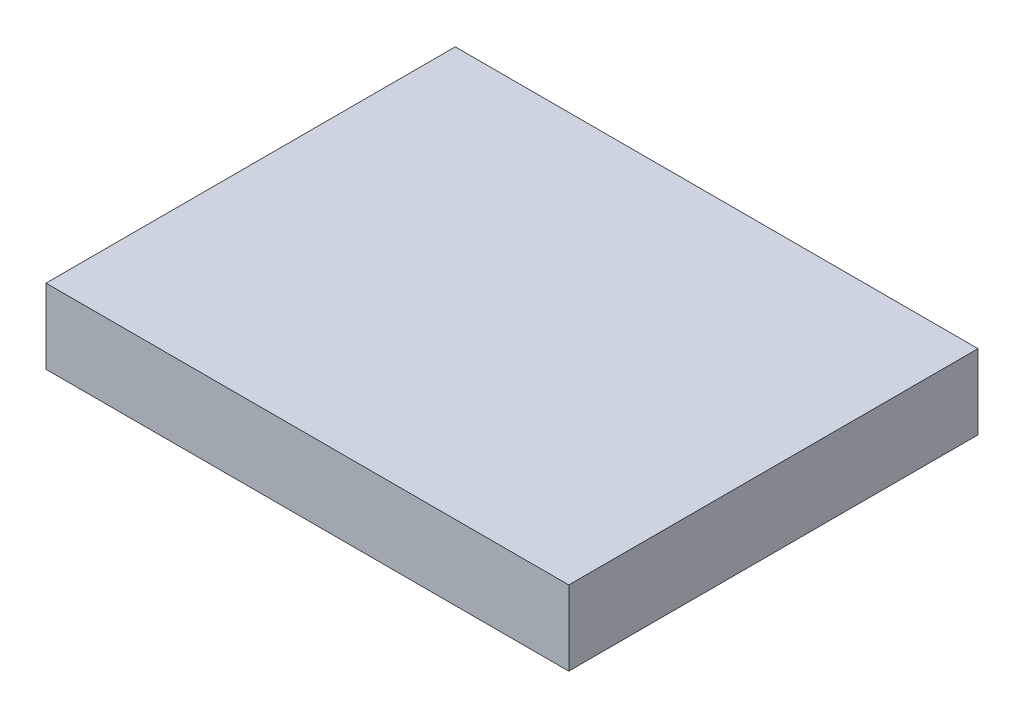
ISO-10303-21;
HEADER;
FILE_DESCRIPTION(('STEP AP214'),'2;1');
FILE_NAME('part.step','',(''),(''),'','','');
FILE_SCHEMA(('AUTOMOTIVE_DESIGN { 1 0 10303 214 1 1 1 1 }'));
ENDSEC;
DATA;
#1=APPLICATION_CONTEXT('core data for automotive mechanical design processes');
#2=APPLICATION_PROTOCOL_DEFINITION('international standard','automotive_design',2000,#1);
#3=PRODUCT_CONTEXT('',#1,'mechanical');
#4=PRODUCT('Part','Part','',(#3));
#5=PRODUCT_RELATED_PRODUCT_CATEGORY('part','',(#4));
#6=PRODUCT_DEFINITION_FORMATION('','',#4);
#7=PRODUCT_DEFINITION_CONTEXT('part definition',#1,'design');
#8=PRODUCT_DEFINITION('design','',#6,#7);
#9=PRODUCT_DEFINITION_SHAPE('','',#8);
#10=(LENGTH_UNIT() NAMED_UNIT(*) SI_UNIT(.MILLI.,.METRE.));
#11=(NAMED_UNIT(*) PLANE_ANGLE_UNIT() SI_UNIT($,.RADIAN.));
#12=(NAMED_UNIT(*) SI_UNIT($,.STERADIAN.) SOLID_ANGLE_UNIT());
#13=UNCERTAINTY_MEASURE_WITH_UNIT(LENGTH_MEASURE(1.E-05),#10,'distance_accuracy_value','');
#14=(GEOMETRIC_REPRESENTATION_CONTEXT(3) GLOBAL_UNCERTAINTY_ASSIGNED_CONTEXT((#13)) GLOBAL_UNIT_ASSIGNED_CONTEXT((#10,
#11,#12)) REPRESENTATION_CONTEXT('',''));
#15=CARTESIAN_POINT('',(0.,0.,0.));
#16=DIRECTION('',(0.,0.,1.));
#17=DIRECTION('',(1.,0.,0.));
#18=AXIS2_PLACEMENT_3D('',#15,#16,#17);
#19=CARTESIAN_POINT('',(22.225,3.175,17.399));
#20=DIRECTION('',(-1.,0.,0.));
#21=DIRECTION('',(0.,0.,1.));
#22=AXIS2_PLACEMENT_3D('',#19,#20,#21);
#23=PLANE('',#22);
#24=DIRECTION('',(0.,0.,-1.));
#25=VECTOR('',#24,1.);
#26=CARTESIAN_POINT('',(22.225,-3.175,17.399));
#27=LINE('',#26,#25);
#28=CARTESIAN_POINT('',(22.225,-3.175,17.399));
#29=VERTEX_POINT('',#28);
#30=CARTESIAN_POINT('',(22.225,-3.175,-17.399));
#31=VERTEX_POINT('',#30);
#32=EDGE_CURVE('E113',#29,#31,#27,.T.);
#33=ORIENTED_EDGE('',*,*,#32,.T.);
#34=DIRECTION('',(0.,-1.,0.));
#35=VECTOR('',#34,1.);
#36=CARTESIAN_POINT('',(22.225,3.175,-17.399));
#37=LINE('',#36,#35);
#38=CARTESIAN_POINT('',(22.225,3.175,-17.399));
#39=VERTEX_POINT('',#38);
#40=EDGE_CURVE('E11',#39,#31,#37,.T.);
#41=ORIENTED_EDGE('',*,*,#40,.F.);
#42=DIRECTION('',(0.,0.,-1.));
#43=VECTOR('',#42,1.);
#44=CARTESIAN_POINT('',(22.225,3.175,17.399));
#45=LINE('',#44,#43);
#46=CARTESIAN_POINT('',(22.225,3.175,17.399));
#47=VERTEX_POINT('',#46);
#48=EDGE_CURVE('E97',#47,#39,#45,.T.);
#49=ORIENTED_EDGE('',*,*,#48,.F.);
#50=DIRECTION('',(0.,-1.,0.));
#51=VECTOR('',#50,1.);
#52=CARTESIAN_POINT('',(22.225,3.175,17.399));
#53=LINE('',#52,#51);
#54=EDGE_CURVE('E109',#47,#29,#53,.T.);
#55=ORIENTED_EDGE('',*,*,#54,.T.);
#56=EDGE_LOOP('',(#33,#41,#49,#55));
#57=FACE_BOUND('',#56,.T.);
#58=ADVANCED_FACE('F45',(#57),#23,.F.);
#59=CARTESIAN_POINT('',(-22.225,3.175,-17.399));
#60=DIRECTION('',(0.,0.,1.));
#61=DIRECTION('',(1.,0.,0.));
#62=AXIS2_PLACEMENT_3D('',#59,#60,#61);
#63=PLANE('',#62);
#64=DIRECTION('',(-1.,0.,0.));
#65=VECTOR('',#64,1.);
#66=CARTESIAN_POINT('',(-22.225,-3.175,-17.399));
#67=LINE('',#66,#65);
#68=CARTESIAN_POINT('',(-22.225,-3.175,-17.399));
#69=VERTEX_POINT('',#68);
#70=EDGE_CURVE('E102',#31,#69,#67,.T.);
#71=ORIENTED_EDGE('',*,*,#70,.T.);
#72=DIRECTION('',(0.,-1.,0.));
#73=VECTOR('',#72,1.);
#74=CARTESIAN_POINT('',(-22.225,3.175,-17.399));
#75=LINE('',#74,#73);
#76=CARTESIAN_POINT('',(-22.225,3.175,-17.399));
#77=VERTEX_POINT('',#76);
#78=EDGE_CURVE('E54',#77,#69,#75,.T.);
#79=ORIENTED_EDGE('',*,*,#78,.F.);
#80=DIRECTION('',(-1.,0.,0.));
#81=VECTOR('',#80,1.);
#82=CARTESIAN_POINT('',(-22.225,3.175,-17.399));
#83=LINE('',#82,#81);
#84=EDGE_CURVE('E92',#39,#77,#83,.T.);
#85=ORIENTED_EDGE('',*,*,#84,.F.);
#86=ORIENTED_EDGE('',*,*,#40,.T.);
#87=EDGE_LOOP('',(#71,#79,#85,#86));
#88=FACE_BOUND('',#87,.T.);
#89=ADVANCED_FACE('F101',(#88),#63,.F.);
#90=CARTESIAN_POINT('',(-22.225,3.175,17.399));
#91=DIRECTION('',(1.,0.,0.));
#92=DIRECTION('',(0.,0.,-1.));
#93=AXIS2_PLACEMENT_3D('',#90,#91,#92);
#94=PLANE('',#93);
#95=DIRECTION('',(0.,0.,1.));
#96=VECTOR('',#95,1.);
#97=CARTESIAN_POINT('',(-22.225,-3.175,17.399));
#98=LINE('',#97,#96);
#99=CARTESIAN_POINT('',(-22.225,-3.175,17.399));
#100=VERTEX_POINT('',#99);
#101=EDGE_CURVE('E79',#69,#100,#98,.T.);
#102=ORIENTED_EDGE('',*,*,#101,.T.);
#103=DIRECTION('',(0.,-1.,0.));
#104=VECTOR('',#103,1.);
#105=CARTESIAN_POINT('',(-22.225,3.175,17.399));
#106=LINE('',#105,#104);
#107=CARTESIAN_POINT('',(-22.225,3.175,17.399));
#108=VERTEX_POINT('',#107);
#109=EDGE_CURVE('E104',#108,#100,#106,.T.);
#110=ORIENTED_EDGE('',*,*,#109,.F.);
#111=DIRECTION('',(0.,0.,1.));
#112=VECTOR('',#111,1.);
#113=CARTESIAN_POINT('',(-22.225,3.175,17.399));
#114=LINE('',#113,#112);
#115=EDGE_CURVE('E95',#77,#108,#114,.T.);
#116=ORIENTED_EDGE('',*,*,#115,.F.);
#117=ORIENTED_EDGE('',*,*,#78,.T.);
#118=EDGE_LOOP('',(#102,#110,#116,#117));
#119=FACE_BOUND('',#118,.T.);
#120=ADVANCED_FACE('F105',(#119),#94,.F.);
#121=CARTESIAN_POINT('',(-22.225,3.175,17.399));
#122=DIRECTION('',(0.,0.,-1.));
#123=DIRECTION('',(-1.,0.,0.));
#124=AXIS2_PLACEMENT_3D('',#121,#122,#123);
#125=PLANE('',#124);
#126=DIRECTION('',(1.,0.,0.));
#127=VECTOR('',#126,1.);
#128=CARTESIAN_POINT('',(-22.225,-3.175,17.399));
#129=LINE('',#128,#127);
#130=EDGE_CURVE('E85',#100,#29,#129,.T.);
#131=ORIENTED_EDGE('',*,*,#130,.T.);
#132=ORIENTED_EDGE('',*,*,#54,.F.);
#133=DIRECTION('',(1.,0.,0.));
#134=VECTOR('',#133,1.);
#135=CARTESIAN_POINT('',(-22.225,3.175,17.399));
#136=LINE('',#135,#134);
#137=EDGE_CURVE('E62',#108,#47,#136,.T.);
#138=ORIENTED_EDGE('',*,*,#137,.F.);
#139=ORIENTED_EDGE('',*,*,#109,.T.);
#140=EDGE_LOOP('',(#131,#132,#138,#139));
#141=FACE_BOUND('',#140,.T.);
#142=ADVANCED_FACE('F126',(#141),#125,.F.);
#143=CARTESIAN_POINT('',(0.,3.175,0.));
#144=DIRECTION('',(0.,-1.,0.));
#145=DIRECTION('',(0.,0.,-1.));
#146=AXIS2_PLACEMENT_3D('',#143,#144,#145);
#147=PLANE('',#146);
#148=ORIENTED_EDGE('',*,*,#48,.T.);
#149=ORIENTED_EDGE('',*,*,#84,.T.);
#150=ORIENTED_EDGE('',*,*,#115,.T.);
#151=ORIENTED_EDGE('',*,*,#137,.T.);
#152=EDGE_LOOP('',(#148,#149,#150,#151));
#153=FACE_BOUND('',#152,.T.);
#154=ADVANCED_FACE('F93',(#153),#147,.F.);
#155=CARTESIAN_POINT('',(0.,-3.175,0.));
#156=DIRECTION('',(0.,-1.,0.));
#157=DIRECTION('',(0.,0.,-1.));
#158=AXIS2_PLACEMENT_3D('',#155,#156,#157);
#159=PLANE('',#158);
#160=ORIENTED_EDGE('',*,*,#32,.F.);
#161=ORIENTED_EDGE('',*,*,#130,.F.);
#162=ORIENTED_EDGE('',*,*,#101,.F.);
#163=ORIENTED_EDGE('',*,*,#70,.F.);
#164=EDGE_LOOP('',(#160,#161,#162,#163));
#165=FACE_BOUND('',#164,.T.);
#166=ADVANCED_FACE('F129',(#165),#159,.T.);
#167=CLOSED_SHELL('',(#58,#89,#120,#142,#154,#166));
#168=MANIFOLD_SOLID_BREP('B2',#167);
#169=ADVANCED_BREP_SHAPE_REPRESENTATION('',(#18,#168),#14);
#170=SHAPE_DEFINITION_REPRESENTATION(#9,#169);
ENDSEC;
END-ISO-10303-21;
